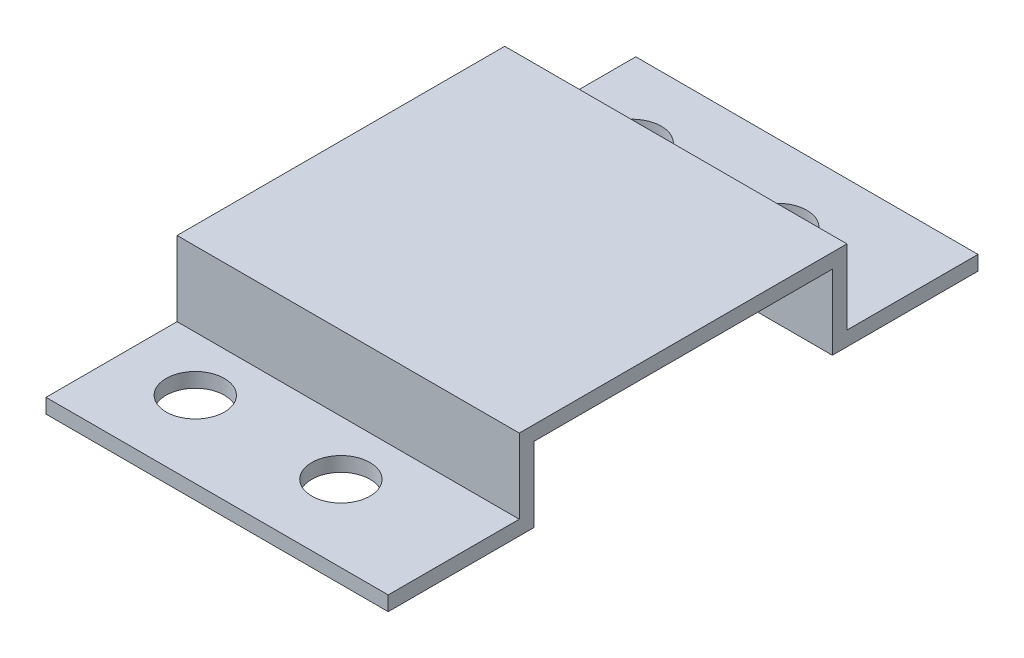
ISO-10303-21;
HEADER;
FILE_DESCRIPTION(('STEP AP214'),'2;1');
FILE_NAME('part.step','',(''),(''),'','','');
FILE_SCHEMA(('AUTOMOTIVE_DESIGN { 1 0 10303 214 1 1 1 1 }'));
ENDSEC;
DATA;
#1=APPLICATION_CONTEXT('core data for automotive mechanical design processes');
#2=APPLICATION_PROTOCOL_DEFINITION('international standard','automotive_design',2000,#1);
#3=PRODUCT_CONTEXT('',#1,'mechanical');
#4=PRODUCT('Part','Part','',(#3));
#5=PRODUCT_RELATED_PRODUCT_CATEGORY('part','',(#4));
#6=PRODUCT_DEFINITION_FORMATION('','',#4);
#7=PRODUCT_DEFINITION_CONTEXT('part definition',#1,'design');
#8=PRODUCT_DEFINITION('design','',#6,#7);
#9=PRODUCT_DEFINITION_SHAPE('','',#8);
#10=(LENGTH_UNIT() NAMED_UNIT(*) SI_UNIT(.MILLI.,.METRE.));
#11=(NAMED_UNIT(*) PLANE_ANGLE_UNIT() SI_UNIT($,.RADIAN.));
#12=(NAMED_UNIT(*) SI_UNIT($,.STERADIAN.) SOLID_ANGLE_UNIT());
#13=UNCERTAINTY_MEASURE_WITH_UNIT(LENGTH_MEASURE(1.E-05),#10,'distance_accuracy_value','');
#14=(GEOMETRIC_REPRESENTATION_CONTEXT(3) GLOBAL_UNCERTAINTY_ASSIGNED_CONTEXT((#13)) GLOBAL_UNIT_ASSIGNED_CONTEXT((#10,
#11,#12)) REPRESENTATION_CONTEXT('',''));
#15=CARTESIAN_POINT('',(0.,0.,0.));
#16=DIRECTION('',(0.,0.,1.));
#17=DIRECTION('',(1.,0.,0.));
#18=AXIS2_PLACEMENT_3D('',#15,#16,#17);
#19=CARTESIAN_POINT('',(47.,2.,40.5));
#20=DIRECTION('',(0.,-1.,0.));
#21=DIRECTION('',(0.,0.,-1.));
#22=AXIS2_PLACEMENT_3D('',#19,#20,#21);
#23=PLANE('',#22);
#24=CARTESIAN_POINT('',(30.,2.,30.));
#25=DIRECTION('',(0.,-1.,0.));
#26=DIRECTION('',(0.,0.,-1.));
#27=AXIS2_PLACEMENT_3D('',#24,#25,#26);
#28=CIRCLE('',#27,4.00000000000001);
#29=CARTESIAN_POINT('',(30.,2.,26.));
#30=VERTEX_POINT('',#29);
#31=EDGE_CURVE('E161',#30,#30,#28,.T.);
#32=ORIENTED_EDGE('',*,*,#31,.T.);
#33=EDGE_LOOP('',(#32));
#34=FACE_BOUND('',#33,.T.);
#35=CARTESIAN_POINT('',(10.,2.,30.));
#36=DIRECTION('',(0.,-1.,0.));
#37=DIRECTION('',(0.,0.,-1.));
#38=AXIS2_PLACEMENT_3D('',#35,#36,#37);
#39=CIRCLE('',#38,4.);
#40=CARTESIAN_POINT('',(10.,2.,26.));
#41=VERTEX_POINT('',#40);
#42=EDGE_CURVE('E208',#41,#41,#39,.T.);
#43=ORIENTED_EDGE('',*,*,#42,.T.);
#44=EDGE_LOOP('',(#43));
#45=FACE_BOUND('',#44,.T.);
#46=DIRECTION('',(0.,0.,-1.));
#47=VECTOR('',#46,1.);
#48=CARTESIAN_POINT('',(0.,2.,40.5));
#49=LINE('',#48,#47);
#50=CARTESIAN_POINT('',(0.,2.,22.5));
#51=VERTEX_POINT('',#50);
#52=CARTESIAN_POINT('',(0.,2.,40.5));
#53=VERTEX_POINT('',#52);
#54=EDGE_CURVE('E157',#51,#53,#49,.F.);
#55=ORIENTED_EDGE('',*,*,#54,.T.);
#56=DIRECTION('',(-1.,0.,0.));
#57=VECTOR('',#56,1.);
#58=CARTESIAN_POINT('',(47.,2.,40.5));
#59=LINE('',#58,#57);
#60=CARTESIAN_POINT('',(47.,2.,40.5));
#61=VERTEX_POINT('',#60);
#62=EDGE_CURVE('E11',#61,#53,#59,.T.);
#63=ORIENTED_EDGE('',*,*,#62,.F.);
#64=DIRECTION('',(0.,0.,-1.));
#65=VECTOR('',#64,1.);
#66=CARTESIAN_POINT('',(47.,2.,40.5));
#67=LINE('',#66,#65);
#68=CARTESIAN_POINT('',(47.,2.,22.5));
#69=VERTEX_POINT('',#68);
#70=EDGE_CURVE('E105',#69,#61,#67,.F.);
#71=ORIENTED_EDGE('',*,*,#70,.F.);
#72=DIRECTION('',(-1.,0.,0.));
#73=VECTOR('',#72,1.);
#74=CARTESIAN_POINT('',(47.,2.,22.5));
#75=LINE('',#74,#73);
#76=EDGE_CURVE('E153',#69,#51,#75,.T.);
#77=ORIENTED_EDGE('',*,*,#76,.T.);
#78=EDGE_LOOP('',(#55,#63,#71,#77));
#79=FACE_BOUND('',#78,.T.);
#80=ADVANCED_FACE('F35',(#34,#45,#79),#23,.F.);
#81=CARTESIAN_POINT('',(47.,0.,40.5));
#82=DIRECTION('',(0.,0.,1.));
#83=DIRECTION('',(1.,0.,0.));
#84=AXIS2_PLACEMENT_3D('',#81,#82,#83);
#85=PLANE('',#84);
#86=DIRECTION('',(0.,1.,0.));
#87=VECTOR('',#86,1.);
#88=CARTESIAN_POINT('',(0.,0.,40.5));
#89=LINE('',#88,#87);
#90=CARTESIAN_POINT('',(0.,0.,40.5));
#91=VERTEX_POINT('',#90);
#92=EDGE_CURVE('E160',#91,#53,#89,.T.);
#93=ORIENTED_EDGE('',*,*,#92,.F.);
#94=DIRECTION('',(-1.,0.,0.));
#95=VECTOR('',#94,1.);
#96=CARTESIAN_POINT('',(47.,0.,40.5));
#97=LINE('',#96,#95);
#98=CARTESIAN_POINT('',(47.,0.,40.5));
#99=VERTEX_POINT('',#98);
#100=EDGE_CURVE('E44',#99,#91,#97,.T.);
#101=ORIENTED_EDGE('',*,*,#100,.F.);
#102=DIRECTION('',(0.,1.,0.));
#103=VECTOR('',#102,1.);
#104=CARTESIAN_POINT('',(47.,0.,40.5));
#105=LINE('',#104,#103);
#106=EDGE_CURVE('E226',#99,#61,#105,.T.);
#107=ORIENTED_EDGE('',*,*,#106,.T.);
#108=ORIENTED_EDGE('',*,*,#62,.T.);
#109=EDGE_LOOP('',(#93,#101,#107,#108));
#110=FACE_BOUND('',#109,.T.);
#111=ADVANCED_FACE('F272',(#110),#85,.T.);
#112=CARTESIAN_POINT('',(47.,0.,40.5));
#113=DIRECTION('',(0.,-1.,0.));
#114=DIRECTION('',(0.,0.,-1.));
#115=AXIS2_PLACEMENT_3D('',#112,#113,#114);
#116=PLANE('',#115);
#117=CARTESIAN_POINT('',(30.,0.,30.));
#118=DIRECTION('',(0.,-1.,0.));
#119=DIRECTION('',(0.,0.,-1.));
#120=AXIS2_PLACEMENT_3D('',#117,#118,#119);
#121=CIRCLE('',#120,4.00000000000001);
#122=CARTESIAN_POINT('',(30.,0.,26.));
#123=VERTEX_POINT('',#122);
#124=EDGE_CURVE('E210',#123,#123,#121,.T.);
#125=ORIENTED_EDGE('',*,*,#124,.F.);
#126=EDGE_LOOP('',(#125));
#127=FACE_BOUND('',#126,.T.);
#128=CARTESIAN_POINT('',(10.,0.,30.));
#129=DIRECTION('',(0.,-1.,0.));
#130=DIRECTION('',(0.,0.,-1.));
#131=AXIS2_PLACEMENT_3D('',#128,#129,#130);
#132=CIRCLE('',#131,4.);
#133=CARTESIAN_POINT('',(10.,0.,26.));
#134=VERTEX_POINT('',#133);
#135=EDGE_CURVE('E204',#134,#134,#132,.T.);
#136=ORIENTED_EDGE('',*,*,#135,.F.);
#137=EDGE_LOOP('',(#136));
#138=FACE_BOUND('',#137,.T.);
#139=DIRECTION('',(0.,0.,1.));
#140=VECTOR('',#139,1.);
#141=CARTESIAN_POINT('',(0.,0.,40.5));
#142=LINE('',#141,#140);
#143=CARTESIAN_POINT('',(0.,0.,20.5));
#144=VERTEX_POINT('',#143);
#145=EDGE_CURVE('E164',#144,#91,#142,.T.);
#146=ORIENTED_EDGE('',*,*,#145,.F.);
#147=DIRECTION('',(-1.,0.,0.));
#148=VECTOR('',#147,1.);
#149=CARTESIAN_POINT('',(47.,0.,20.5));
#150=LINE('',#149,#148);
#151=CARTESIAN_POINT('',(47.,0.,20.5));
#152=VERTEX_POINT('',#151);
#153=EDGE_CURVE('E200',#152,#144,#150,.T.);
#154=ORIENTED_EDGE('',*,*,#153,.F.);
#155=DIRECTION('',(0.,0.,1.));
#156=VECTOR('',#155,1.);
#157=CARTESIAN_POINT('',(47.,0.,40.5));
#158=LINE('',#157,#156);
#159=EDGE_CURVE('E229',#152,#99,#158,.T.);
#160=ORIENTED_EDGE('',*,*,#159,.T.);
#161=ORIENTED_EDGE('',*,*,#100,.T.);
#162=EDGE_LOOP('',(#146,#154,#160,#161));
#163=FACE_BOUND('',#162,.T.);
#164=ADVANCED_FACE('F277',(#127,#138,#163),#116,.T.);
#165=CARTESIAN_POINT('',(47.,0.,20.5));
#166=DIRECTION('',(0.,0.,-1.));
#167=DIRECTION('',(0.,1.,0.));
#168=AXIS2_PLACEMENT_3D('',#165,#166,#167);
#169=PLANE('',#168);
#170=DIRECTION('',(0.,-1.,0.));
#171=VECTOR('',#170,1.);
#172=CARTESIAN_POINT('',(0.,0.,20.5));
#173=LINE('',#172,#171);
#174=CARTESIAN_POINT('',(0.,10.25,20.5));
#175=VERTEX_POINT('',#174);
#176=EDGE_CURVE('E167',#175,#144,#173,.T.);
#177=ORIENTED_EDGE('',*,*,#176,.F.);
#178=DIRECTION('',(-1.,0.,0.));
#179=VECTOR('',#178,1.);
#180=CARTESIAN_POINT('',(47.,10.25,20.5));
#181=LINE('',#180,#179);
#182=CARTESIAN_POINT('',(47.,10.25,20.5));
#183=VERTEX_POINT('',#182);
#184=EDGE_CURVE('E198',#183,#175,#181,.T.);
#185=ORIENTED_EDGE('',*,*,#184,.F.);
#186=DIRECTION('',(0.,-1.,0.));
#187=VECTOR('',#186,1.);
#188=CARTESIAN_POINT('',(47.,0.,20.5));
#189=LINE('',#188,#187);
#190=EDGE_CURVE('E232',#183,#152,#189,.T.);
#191=ORIENTED_EDGE('',*,*,#190,.T.);
#192=ORIENTED_EDGE('',*,*,#153,.T.);
#193=EDGE_LOOP('',(#177,#185,#191,#192));
#194=FACE_BOUND('',#193,.T.);
#195=ADVANCED_FACE('F290',(#194),#169,.T.);
#196=CARTESIAN_POINT('',(47.,10.25,20.5));
#197=DIRECTION('',(0.,-1.,0.));
#198=DIRECTION('',(0.,0.,-1.));
#199=AXIS2_PLACEMENT_3D('',#196,#197,#198);
#200=PLANE('',#199);
#201=DIRECTION('',(0.,0.,1.));
#202=VECTOR('',#201,1.);
#203=CARTESIAN_POINT('',(0.,10.25,20.5));
#204=LINE('',#203,#202);
#205=CARTESIAN_POINT('',(0.,10.25,-20.5));
#206=VERTEX_POINT('',#205);
#207=EDGE_CURVE('E170',#206,#175,#204,.T.);
#208=ORIENTED_EDGE('',*,*,#207,.F.);
#209=DIRECTION('',(-1.,0.,0.));
#210=VECTOR('',#209,1.);
#211=CARTESIAN_POINT('',(47.,10.25,-20.5));
#212=LINE('',#211,#210);
#213=CARTESIAN_POINT('',(47.,10.25,-20.5));
#214=VERTEX_POINT('',#213);
#215=EDGE_CURVE('E196',#214,#206,#212,.T.);
#216=ORIENTED_EDGE('',*,*,#215,.F.);
#217=DIRECTION('',(0.,0.,1.));
#218=VECTOR('',#217,1.);
#219=CARTESIAN_POINT('',(47.,10.25,20.5));
#220=LINE('',#219,#218);
#221=EDGE_CURVE('E235',#214,#183,#220,.T.);
#222=ORIENTED_EDGE('',*,*,#221,.T.);
#223=ORIENTED_EDGE('',*,*,#184,.T.);
#224=EDGE_LOOP('',(#208,#216,#222,#223));
#225=FACE_BOUND('',#224,.T.);
#226=ADVANCED_FACE('F293',(#225),#200,.T.);
#227=CARTESIAN_POINT('',(47.,0.,-20.5));
#228=DIRECTION('',(0.,0.,1.));
#229=DIRECTION('',(0.,-1.,0.));
#230=AXIS2_PLACEMENT_3D('',#227,#228,#229);
#231=PLANE('',#230);
#232=DIRECTION('',(0.,1.,0.));
#233=VECTOR('',#232,1.);
#234=CARTESIAN_POINT('',(0.,0.,-20.5));
#235=LINE('',#234,#233);
#236=CARTESIAN_POINT('',(0.,0.,-20.5));
#237=VERTEX_POINT('',#236);
#238=EDGE_CURVE('E173',#237,#206,#235,.T.);
#239=ORIENTED_EDGE('',*,*,#238,.F.);
#240=DIRECTION('',(-1.,0.,0.));
#241=VECTOR('',#240,1.);
#242=CARTESIAN_POINT('',(47.,0.,-20.5));
#243=LINE('',#242,#241);
#244=CARTESIAN_POINT('',(47.,0.,-20.5));
#245=VERTEX_POINT('',#244);
#246=EDGE_CURVE('E194',#245,#237,#243,.T.);
#247=ORIENTED_EDGE('',*,*,#246,.F.);
#248=DIRECTION('',(0.,1.,0.));
#249=VECTOR('',#248,1.);
#250=CARTESIAN_POINT('',(47.,0.,-20.5));
#251=LINE('',#250,#249);
#252=EDGE_CURVE('E238',#245,#214,#251,.T.);
#253=ORIENTED_EDGE('',*,*,#252,.T.);
#254=ORIENTED_EDGE('',*,*,#215,.T.);
#255=EDGE_LOOP('',(#239,#247,#253,#254));
#256=FACE_BOUND('',#255,.T.);
#257=ADVANCED_FACE('F295',(#256),#231,.T.);
#258=CARTESIAN_POINT('',(47.,0.,-40.5));
#259=DIRECTION('',(0.,-1.,0.));
#260=DIRECTION('',(0.,0.,-1.));
#261=AXIS2_PLACEMENT_3D('',#258,#259,#260);
#262=PLANE('',#261);
#263=CARTESIAN_POINT('',(10.0000000000006,0.,-30.));
#264=DIRECTION('',(0.,-1.,0.));
#265=DIRECTION('',(0.,0.,-1.));
#266=AXIS2_PLACEMENT_3D('',#263,#264,#265);
#267=CIRCLE('',#266,4.);
#268=CARTESIAN_POINT('',(10.0000000000006,0.,-34.));
#269=VERTEX_POINT('',#268);
#270=EDGE_CURVE('E219',#269,#269,#267,.T.);
#271=ORIENTED_EDGE('',*,*,#270,.F.);
#272=EDGE_LOOP('',(#271));
#273=FACE_BOUND('',#272,.T.);
#274=CARTESIAN_POINT('',(30.0000000000006,0.,-30.));
#275=DIRECTION('',(0.,-1.,0.));
#276=DIRECTION('',(0.,0.,-1.));
#277=AXIS2_PLACEMENT_3D('',#274,#275,#276);
#278=CIRCLE('',#277,4.);
#279=CARTESIAN_POINT('',(30.0000000000006,0.,-34.));
#280=VERTEX_POINT('',#279);
#281=EDGE_CURVE('E215',#280,#280,#278,.T.);
#282=ORIENTED_EDGE('',*,*,#281,.F.);
#283=EDGE_LOOP('',(#282));
#284=FACE_BOUND('',#283,.T.);
#285=DIRECTION('',(0.,0.,1.));
#286=VECTOR('',#285,1.);
#287=CARTESIAN_POINT('',(0.,0.,-40.5));
#288=LINE('',#287,#286);
#289=CARTESIAN_POINT('',(0.,0.,-40.5));
#290=VERTEX_POINT('',#289);
#291=EDGE_CURVE('E176',#290,#237,#288,.T.);
#292=ORIENTED_EDGE('',*,*,#291,.F.);
#293=DIRECTION('',(-1.,0.,0.));
#294=VECTOR('',#293,1.);
#295=CARTESIAN_POINT('',(47.,0.,-40.5));
#296=LINE('',#295,#294);
#297=CARTESIAN_POINT('',(47.,0.,-40.5));
#298=VERTEX_POINT('',#297);
#299=EDGE_CURVE('E192',#298,#290,#296,.T.);
#300=ORIENTED_EDGE('',*,*,#299,.F.);
#301=DIRECTION('',(0.,0.,1.));
#302=VECTOR('',#301,1.);
#303=CARTESIAN_POINT('',(47.,0.,-40.5));
#304=LINE('',#303,#302);
#305=EDGE_CURVE('E241',#298,#245,#304,.T.);
#306=ORIENTED_EDGE('',*,*,#305,.T.);
#307=ORIENTED_EDGE('',*,*,#246,.T.);
#308=EDGE_LOOP('',(#292,#300,#306,#307));
#309=FACE_BOUND('',#308,.T.);
#310=ADVANCED_FACE('F254',(#273,#284,#309),#262,.T.);
#311=CARTESIAN_POINT('',(47.,2.,-40.5));
#312=DIRECTION('',(0.,0.,-1.));
#313=DIRECTION('',(-1.,0.,0.));
#314=AXIS2_PLACEMENT_3D('',#311,#312,#313);
#315=PLANE('',#314);
#316=DIRECTION('',(0.,-1.,0.));
#317=VECTOR('',#316,1.);
#318=CARTESIAN_POINT('',(0.,2.,-40.5));
#319=LINE('',#318,#317);
#320=CARTESIAN_POINT('',(0.,2.,-40.5));
#321=VERTEX_POINT('',#320);
#322=EDGE_CURVE('E179',#321,#290,#319,.T.);
#323=ORIENTED_EDGE('',*,*,#322,.F.);
#324=DIRECTION('',(-1.,0.,0.));
#325=VECTOR('',#324,1.);
#326=CARTESIAN_POINT('',(47.,2.,-40.5));
#327=LINE('',#326,#325);
#328=CARTESIAN_POINT('',(47.,2.,-40.5));
#329=VERTEX_POINT('',#328);
#330=EDGE_CURVE('E190',#329,#321,#327,.T.);
#331=ORIENTED_EDGE('',*,*,#330,.F.);
#332=DIRECTION('',(0.,-1.,0.));
#333=VECTOR('',#332,1.);
#334=CARTESIAN_POINT('',(47.,2.,-40.5));
#335=LINE('',#334,#333);
#336=EDGE_CURVE('E244',#329,#298,#335,.T.);
#337=ORIENTED_EDGE('',*,*,#336,.T.);
#338=ORIENTED_EDGE('',*,*,#299,.T.);
#339=EDGE_LOOP('',(#323,#331,#337,#338));
#340=FACE_BOUND('',#339,.T.);
#341=ADVANCED_FACE('F248',(#340),#315,.T.);
#342=CARTESIAN_POINT('',(47.,2.,-40.5));
#343=DIRECTION('',(0.,-1.,0.));
#344=DIRECTION('',(0.,0.,-1.));
#345=AXIS2_PLACEMENT_3D('',#342,#343,#344);
#346=PLANE('',#345);
#347=CARTESIAN_POINT('',(10.0000000000006,2.,-30.));
#348=DIRECTION('',(0.,-1.,0.));
#349=DIRECTION('',(0.,0.,-1.));
#350=AXIS2_PLACEMENT_3D('',#347,#348,#349);
#351=CIRCLE('',#350,4.);
#352=CARTESIAN_POINT('',(10.0000000000006,2.,-34.));
#353=VERTEX_POINT('',#352);
#354=EDGE_CURVE('E38',#353,#353,#351,.T.);
#355=ORIENTED_EDGE('',*,*,#354,.T.);
#356=EDGE_LOOP('',(#355));
#357=FACE_BOUND('',#356,.T.);
#358=CARTESIAN_POINT('',(30.0000000000006,2.,-30.));
#359=DIRECTION('',(0.,-1.,0.));
#360=DIRECTION('',(0.,0.,-1.));
#361=AXIS2_PLACEMENT_3D('',#358,#359,#360);
#362=CIRCLE('',#361,4.);
#363=CARTESIAN_POINT('',(30.0000000000006,2.,-34.));
#364=VERTEX_POINT('',#363);
#365=EDGE_CURVE('E202',#364,#364,#362,.T.);
#366=ORIENTED_EDGE('',*,*,#365,.T.);
#367=EDGE_LOOP('',(#366));
#368=FACE_BOUND('',#367,.T.);
#369=DIRECTION('',(0.,0.,-1.));
#370=VECTOR('',#369,1.);
#371=CARTESIAN_POINT('',(0.,2.,-40.5));
#372=LINE('',#371,#370);
#373=CARTESIAN_POINT('',(0.,2.,-22.5));
#374=VERTEX_POINT('',#373);
#375=EDGE_CURVE('E182',#321,#374,#372,.F.);
#376=ORIENTED_EDGE('',*,*,#375,.T.);
#377=DIRECTION('',(-1.,0.,0.));
#378=VECTOR('',#377,1.);
#379=CARTESIAN_POINT('',(47.,2.,-22.5));
#380=LINE('',#379,#378);
#381=CARTESIAN_POINT('',(47.,2.,-22.5));
#382=VERTEX_POINT('',#381);
#383=EDGE_CURVE('E148',#382,#374,#380,.T.);
#384=ORIENTED_EDGE('',*,*,#383,.F.);
#385=DIRECTION('',(0.,0.,-1.));
#386=VECTOR('',#385,1.);
#387=CARTESIAN_POINT('',(47.,2.,-40.5));
#388=LINE('',#387,#386);
#389=EDGE_CURVE('E139',#329,#382,#388,.F.);
#390=ORIENTED_EDGE('',*,*,#389,.F.);
#391=ORIENTED_EDGE('',*,*,#330,.T.);
#392=EDGE_LOOP('',(#376,#384,#390,#391));
#393=FACE_BOUND('',#392,.T.);
#394=ADVANCED_FACE('F261',(#357,#368,#393),#346,.F.);
#395=CARTESIAN_POINT('',(47.,0.,-22.5));
#396=DIRECTION('',(0.,0.,1.));
#397=DIRECTION('',(0.,-1.,0.));
#398=AXIS2_PLACEMENT_3D('',#395,#396,#397);
#399=PLANE('',#398);
#400=DIRECTION('',(0.,1.,0.));
#401=VECTOR('',#400,1.);
#402=CARTESIAN_POINT('',(0.,0.,-22.5));
#403=LINE('',#402,#401);
#404=CARTESIAN_POINT('',(0.,12.25,-22.5));
#405=VERTEX_POINT('',#404);
#406=EDGE_CURVE('E147',#374,#405,#403,.T.);
#407=ORIENTED_EDGE('',*,*,#406,.T.);
#408=DIRECTION('',(-1.,0.,0.));
#409=VECTOR('',#408,1.);
#410=CARTESIAN_POINT('',(47.,12.25,-22.5));
#411=LINE('',#410,#409);
#412=CARTESIAN_POINT('',(47.,12.25,-22.5));
#413=VERTEX_POINT('',#412);
#414=EDGE_CURVE('E144',#413,#405,#411,.T.);
#415=ORIENTED_EDGE('',*,*,#414,.F.);
#416=DIRECTION('',(0.,1.,0.));
#417=VECTOR('',#416,1.);
#418=CARTESIAN_POINT('',(47.,0.,-22.5));
#419=LINE('',#418,#417);
#420=EDGE_CURVE('E132',#382,#413,#419,.T.);
#421=ORIENTED_EDGE('',*,*,#420,.F.);
#422=ORIENTED_EDGE('',*,*,#383,.T.);
#423=EDGE_LOOP('',(#407,#415,#421,#422));
#424=FACE_BOUND('',#423,.T.);
#425=ADVANCED_FACE('F145',(#424),#399,.F.);
#426=CARTESIAN_POINT('',(47.,12.25,20.5));
#427=DIRECTION('',(0.,-1.,0.));
#428=DIRECTION('',(0.,0.,-1.));
#429=AXIS2_PLACEMENT_3D('',#426,#427,#428);
#430=PLANE('',#429);
#431=DIRECTION('',(0.,0.,-1.));
#432=VECTOR('',#431,1.);
#433=CARTESIAN_POINT('',(0.,12.25,20.5));
#434=LINE('',#433,#432);
#435=CARTESIAN_POINT('',(0.,12.25,22.5));
#436=VERTEX_POINT('',#435);
#437=EDGE_CURVE('E93',#405,#436,#434,.F.);
#438=ORIENTED_EDGE('',*,*,#437,.T.);
#439=DIRECTION('',(-1.,0.,0.));
#440=VECTOR('',#439,1.);
#441=CARTESIAN_POINT('',(47.,12.25,22.5));
#442=LINE('',#441,#440);
#443=CARTESIAN_POINT('',(47.,12.25,22.5));
#444=VERTEX_POINT('',#443);
#445=EDGE_CURVE('E149',#444,#436,#442,.T.);
#446=ORIENTED_EDGE('',*,*,#445,.F.);
#447=DIRECTION('',(0.,0.,-1.));
#448=VECTOR('',#447,1.);
#449=CARTESIAN_POINT('',(47.,12.25,20.5));
#450=LINE('',#449,#448);
#451=EDGE_CURVE('E136',#413,#444,#450,.F.);
#452=ORIENTED_EDGE('',*,*,#451,.F.);
#453=ORIENTED_EDGE('',*,*,#414,.T.);
#454=EDGE_LOOP('',(#438,#446,#452,#453));
#455=FACE_BOUND('',#454,.T.);
#456=ADVANCED_FACE('F151',(#455),#430,.F.);
#457=CARTESIAN_POINT('',(47.,0.,22.5));
#458=DIRECTION('',(0.,0.,-1.));
#459=DIRECTION('',(0.,1.,0.));
#460=AXIS2_PLACEMENT_3D('',#457,#458,#459);
#461=PLANE('',#460);
#462=DIRECTION('',(0.,-1.,0.));
#463=VECTOR('',#462,1.);
#464=CARTESIAN_POINT('',(0.,0.,22.5));
#465=LINE('',#464,#463);
#466=EDGE_CURVE('E99',#436,#51,#465,.T.);
#467=ORIENTED_EDGE('',*,*,#466,.T.);
#468=ORIENTED_EDGE('',*,*,#76,.F.);
#469=DIRECTION('',(0.,-1.,0.));
#470=VECTOR('',#469,1.);
#471=CARTESIAN_POINT('',(47.,0.,22.5));
#472=LINE('',#471,#470);
#473=EDGE_CURVE('E53',#444,#69,#472,.T.);
#474=ORIENTED_EDGE('',*,*,#473,.F.);
#475=ORIENTED_EDGE('',*,*,#445,.T.);
#476=EDGE_LOOP('',(#467,#468,#474,#475));
#477=FACE_BOUND('',#476,.T.);
#478=ADVANCED_FACE('F335',(#477),#461,.F.);
#479=CARTESIAN_POINT('',(47.,0.,0.));
#480=DIRECTION('',(1.,0.,0.));
#481=DIRECTION('',(0.,0.,-1.));
#482=AXIS2_PLACEMENT_3D('',#479,#480,#481);
#483=PLANE('',#482);
#484=ORIENTED_EDGE('',*,*,#70,.T.);
#485=ORIENTED_EDGE('',*,*,#106,.F.);
#486=ORIENTED_EDGE('',*,*,#159,.F.);
#487=ORIENTED_EDGE('',*,*,#190,.F.);
#488=ORIENTED_EDGE('',*,*,#221,.F.);
#489=ORIENTED_EDGE('',*,*,#252,.F.);
#490=ORIENTED_EDGE('',*,*,#305,.F.);
#491=ORIENTED_EDGE('',*,*,#336,.F.);
#492=ORIENTED_EDGE('',*,*,#389,.T.);
#493=ORIENTED_EDGE('',*,*,#420,.T.);
#494=ORIENTED_EDGE('',*,*,#451,.T.);
#495=ORIENTED_EDGE('',*,*,#473,.T.);
#496=EDGE_LOOP('',(#484,#485,#486,#487,#488,#489,#490,#491,#492,#493,#494,#495));
#497=FACE_BOUND('',#496,.T.);
#498=ADVANCED_FACE('F134',(#497),#483,.T.);
#499=CARTESIAN_POINT('',(0.,0.,0.));
#500=DIRECTION('',(1.,0.,0.));
#501=DIRECTION('',(0.,0.,-1.));
#502=AXIS2_PLACEMENT_3D('',#499,#500,#501);
#503=PLANE('',#502);
#504=ORIENTED_EDGE('',*,*,#54,.F.);
#505=ORIENTED_EDGE('',*,*,#466,.F.);
#506=ORIENTED_EDGE('',*,*,#437,.F.);
#507=ORIENTED_EDGE('',*,*,#406,.F.);
#508=ORIENTED_EDGE('',*,*,#375,.F.);
#509=ORIENTED_EDGE('',*,*,#322,.T.);
#510=ORIENTED_EDGE('',*,*,#291,.T.);
#511=ORIENTED_EDGE('',*,*,#238,.T.);
#512=ORIENTED_EDGE('',*,*,#207,.T.);
#513=ORIENTED_EDGE('',*,*,#176,.T.);
#514=ORIENTED_EDGE('',*,*,#145,.T.);
#515=ORIENTED_EDGE('',*,*,#92,.T.);
#516=EDGE_LOOP('',(#504,#505,#506,#507,#508,#509,#510,#511,#512,#513,#514,#515));
#517=FACE_BOUND('',#516,.T.);
#518=ADVANCED_FACE('F259',(#517),#503,.F.);
#519=CARTESIAN_POINT('',(30.0000000000006,10.,-30.));
#520=DIRECTION('',(0.,-1.,0.));
#521=DIRECTION('',(0.,0.,-1.));
#522=AXIS2_PLACEMENT_3D('',#519,#520,#521);
#523=CYLINDRICAL_SURFACE('',#522,4.);
#524=ORIENTED_EDGE('',*,*,#281,.T.);
#525=EDGE_LOOP('',(#524));
#526=FACE_BOUND('',#525,.T.);
#527=ORIENTED_EDGE('',*,*,#365,.F.);
#528=EDGE_LOOP('',(#527));
#529=FACE_BOUND('',#528,.T.);
#530=ADVANCED_FACE('F326',(#526,#529),#523,.F.);
#531=CARTESIAN_POINT('',(10.0000000000006,10.,-30.));
#532=DIRECTION('',(0.,-1.,0.));
#533=DIRECTION('',(0.,0.,-1.));
#534=AXIS2_PLACEMENT_3D('',#531,#532,#533);
#535=CYLINDRICAL_SURFACE('',#534,4.);
#536=ORIENTED_EDGE('',*,*,#270,.T.);
#537=EDGE_LOOP('',(#536));
#538=FACE_BOUND('',#537,.T.);
#539=ORIENTED_EDGE('',*,*,#354,.F.);
#540=EDGE_LOOP('',(#539));
#541=FACE_BOUND('',#540,.T.);
#542=ADVANCED_FACE('F323',(#538,#541),#535,.F.);
#543=CARTESIAN_POINT('',(10.,10.,30.));
#544=DIRECTION('',(0.,-1.,0.));
#545=DIRECTION('',(0.,0.,-1.));
#546=AXIS2_PLACEMENT_3D('',#543,#544,#545);
#547=CYLINDRICAL_SURFACE('',#546,4.);
#548=ORIENTED_EDGE('',*,*,#135,.T.);
#549=EDGE_LOOP('',(#548));
#550=FACE_BOUND('',#549,.T.);
#551=ORIENTED_EDGE('',*,*,#42,.F.);
#552=EDGE_LOOP('',(#551));
#553=FACE_BOUND('',#552,.T.);
#554=ADVANCED_FACE('F318',(#550,#553),#547,.F.);
#555=CARTESIAN_POINT('',(30.,10.,30.));
#556=DIRECTION('',(0.,-1.,0.));
#557=DIRECTION('',(0.,0.,-1.));
#558=AXIS2_PLACEMENT_3D('',#555,#556,#557);
#559=CYLINDRICAL_SURFACE('',#558,4.00000000000001);
#560=ORIENTED_EDGE('',*,*,#124,.T.);
#561=EDGE_LOOP('',(#560));
#562=FACE_BOUND('',#561,.T.);
#563=ORIENTED_EDGE('',*,*,#31,.F.);
#564=EDGE_LOOP('',(#563));
#565=FACE_BOUND('',#564,.T.);
#566=ADVANCED_FACE('F315',(#562,#565),#559,.F.);
#567=CLOSED_SHELL('',(#80,#111,#164,#195,#226,#257,#310,#341,#394,#425,#456,#478,#498,#518,#530,
#542,#554,#566));
#568=MANIFOLD_SOLID_BREP('B2',#567);
#569=ADVANCED_BREP_SHAPE_REPRESENTATION('',(#18,#568),#14);
#570=SHAPE_DEFINITION_REPRESENTATION(#9,#569);
ENDSEC;
END-ISO-10303-21;
